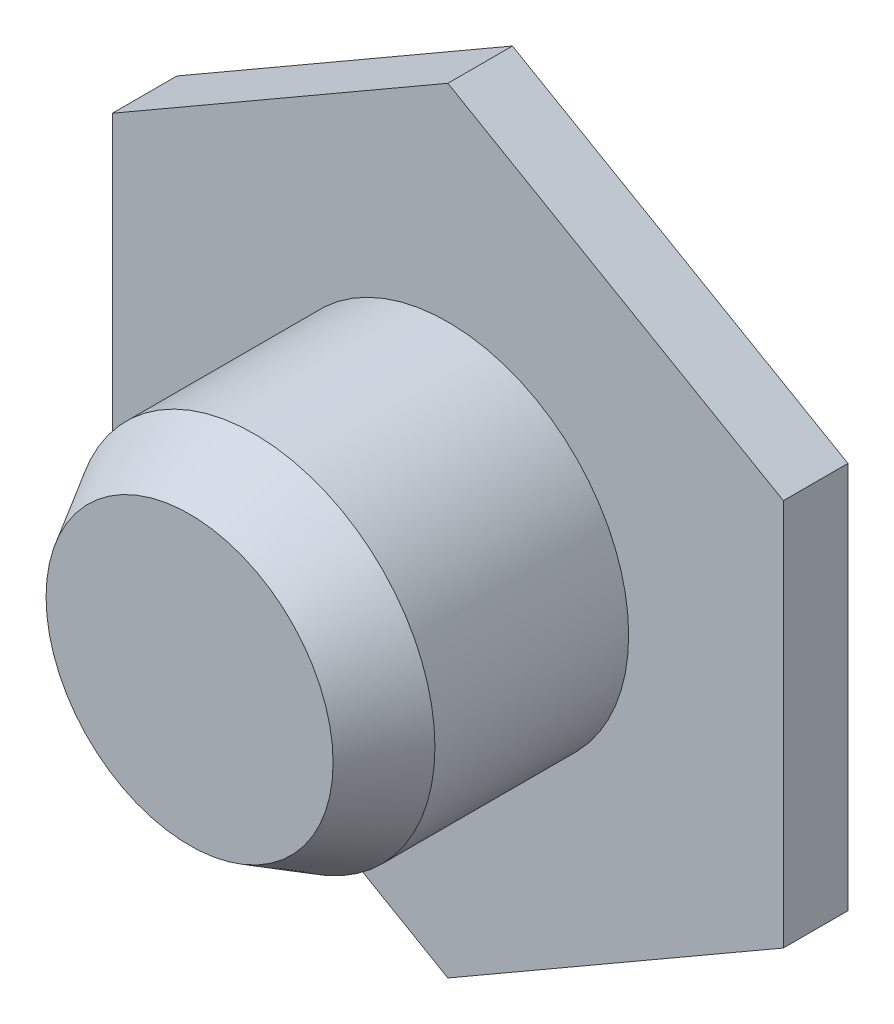
ISO-10303-21;
HEADER;
FILE_DESCRIPTION(('STEP AP214'),'2;1');
FILE_NAME('part.step','',(''),(''),'','','');
FILE_SCHEMA(('AUTOMOTIVE_DESIGN { 1 0 10303 214 1 1 1 1 }'));
ENDSEC;
DATA;
#1=APPLICATION_CONTEXT('core data for automotive mechanical design processes');
#2=APPLICATION_PROTOCOL_DEFINITION('international standard','automotive_design',2000,#1);
#3=PRODUCT_CONTEXT('',#1,'mechanical');
#4=PRODUCT('Part','Part','',(#3));
#5=PRODUCT_RELATED_PRODUCT_CATEGORY('part','',(#4));
#6=PRODUCT_DEFINITION_FORMATION('','',#4);
#7=PRODUCT_DEFINITION_CONTEXT('part definition',#1,'design');
#8=PRODUCT_DEFINITION('design','',#6,#7);
#9=PRODUCT_DEFINITION_SHAPE('','',#8);
#10=(LENGTH_UNIT() NAMED_UNIT(*) SI_UNIT(.MILLI.,.METRE.));
#11=(NAMED_UNIT(*) PLANE_ANGLE_UNIT() SI_UNIT($,.RADIAN.));
#12=(NAMED_UNIT(*) SI_UNIT($,.STERADIAN.) SOLID_ANGLE_UNIT());
#13=UNCERTAINTY_MEASURE_WITH_UNIT(LENGTH_MEASURE(1.E-05),#10,'distance_accuracy_value','');
#14=(GEOMETRIC_REPRESENTATION_CONTEXT(3) GLOBAL_UNCERTAINTY_ASSIGNED_CONTEXT((#13)) GLOBAL_UNIT_ASSIGNED_CONTEXT((#10,
#11,#12)) REPRESENTATION_CONTEXT('',''));
#15=CARTESIAN_POINT('',(0.,0.,0.));
#16=DIRECTION('',(0.,0.,1.));
#17=DIRECTION('',(1.,0.,0.));
#18=AXIS2_PLACEMENT_3D('',#15,#16,#17);
#19=CARTESIAN_POINT('',(0.,0.,0.5));
#20=DIRECTION('',(0.,0.,1.));
#21=DIRECTION('',(1.,0.,0.));
#22=AXIS2_PLACEMENT_3D('',#19,#20,#21);
#23=PLANE('',#22);
#24=DIRECTION('',(-0.866025403784439,0.5,0.));
#25=VECTOR('',#24,1.);
#26=CARTESIAN_POINT('',(2.59807621135331,1.5,0.5));
#27=LINE('',#26,#25);
#28=CARTESIAN_POINT('',(2.59807621135331,1.5,0.5));
#29=VERTEX_POINT('',#28);
#30=CARTESIAN_POINT('',(0.,3.,0.5));
#31=VERTEX_POINT('',#30);
#32=EDGE_CURVE('E129',#29,#31,#27,.T.);
#33=ORIENTED_EDGE('',*,*,#32,.T.);
#34=DIRECTION('',(-0.866025403784439,-0.5,0.));
#35=VECTOR('',#34,1.);
#36=CARTESIAN_POINT('',(0.,3.,0.5));
#37=LINE('',#36,#35);
#38=CARTESIAN_POINT('',(-2.59807621135332,1.5,0.5));
#39=VERTEX_POINT('',#38);
#40=EDGE_CURVE('E87',#31,#39,#37,.T.);
#41=ORIENTED_EDGE('',*,*,#40,.T.);
#42=DIRECTION('',(0.,-1.,0.));
#43=VECTOR('',#42,1.);
#44=CARTESIAN_POINT('',(-2.59807621135332,1.5,0.5));
#45=LINE('',#44,#43);
#46=CARTESIAN_POINT('',(-2.59807621135331,-1.5,0.5));
#47=VERTEX_POINT('',#46);
#48=EDGE_CURVE('E100',#39,#47,#45,.T.);
#49=ORIENTED_EDGE('',*,*,#48,.T.);
#50=DIRECTION('',(0.866025403784439,-0.5,0.));
#51=VECTOR('',#50,1.);
#52=CARTESIAN_POINT('',(-2.59807621135331,-1.5,0.5));
#53=LINE('',#52,#51);
#54=CARTESIAN_POINT('',(0.,-3.,0.5));
#55=VERTEX_POINT('',#54);
#56=EDGE_CURVE('E94',#47,#55,#53,.T.);
#57=ORIENTED_EDGE('',*,*,#56,.T.);
#58=DIRECTION('',(0.866025403784439,0.5,0.));
#59=VECTOR('',#58,1.);
#60=CARTESIAN_POINT('',(0.,-3.,0.5));
#61=LINE('',#60,#59);
#62=CARTESIAN_POINT('',(2.59807621135331,-1.5,0.5));
#63=VERTEX_POINT('',#62);
#64=EDGE_CURVE('E98',#55,#63,#61,.T.);
#65=ORIENTED_EDGE('',*,*,#64,.T.);
#66=DIRECTION('',(0.,1.,0.));
#67=VECTOR('',#66,1.);
#68=CARTESIAN_POINT('',(2.59807621135331,-1.5,0.5));
#69=LINE('',#68,#67);
#70=EDGE_CURVE('E50',#63,#29,#69,.T.);
#71=ORIENTED_EDGE('',*,*,#70,.T.);
#72=EDGE_LOOP('',(#33,#41,#49,#57,#65,#71));
#73=FACE_BOUND('',#72,.T.);
#74=CARTESIAN_POINT('',(0.,0.,0.5));
#75=DIRECTION('',(0.,0.,1.));
#76=DIRECTION('',(1.,0.,0.));
#77=AXIS2_PLACEMENT_3D('',#74,#75,#76);
#78=CIRCLE('',#77,1.4);
#79=CARTESIAN_POINT('',(1.4,0.,0.5));
#80=VERTEX_POINT('',#79);
#81=EDGE_CURVE('E174',#80,#80,#78,.T.);
#82=ORIENTED_EDGE('',*,*,#81,.F.);
#83=EDGE_LOOP('',(#82));
#84=FACE_BOUND('',#83,.T.);
#85=ADVANCED_FACE('F33',(#73,#84),#23,.T.);
#86=CARTESIAN_POINT('',(2.59807621135331,1.5,0.5));
#87=DIRECTION('',(-0.5,-0.866025403784439,0.));
#88=DIRECTION('',(0.866025403784439,-0.5,0.));
#89=AXIS2_PLACEMENT_3D('',#86,#87,#88);
#90=PLANE('',#89);
#91=DIRECTION('',(-0.866025403784439,0.5,0.));
#92=VECTOR('',#91,1.);
#93=CARTESIAN_POINT('',(2.59807621135331,1.5,0.));
#94=LINE('',#93,#92);
#95=CARTESIAN_POINT('',(2.59807621135331,1.5,0.));
#96=VERTEX_POINT('',#95);
#97=CARTESIAN_POINT('',(0.,3.,0.));
#98=VERTEX_POINT('',#97);
#99=EDGE_CURVE('E118',#96,#98,#94,.T.);
#100=ORIENTED_EDGE('',*,*,#99,.T.);
#101=DIRECTION('',(0.,0.,-1.));
#102=VECTOR('',#101,1.);
#103=CARTESIAN_POINT('',(0.,3.,0.5));
#104=LINE('',#103,#102);
#105=EDGE_CURVE('E11',#31,#98,#104,.T.);
#106=ORIENTED_EDGE('',*,*,#105,.F.);
#107=ORIENTED_EDGE('',*,*,#32,.F.);
#108=DIRECTION('',(0.,0.,-1.));
#109=VECTOR('',#108,1.);
#110=CARTESIAN_POINT('',(2.59807621135331,1.5,0.5));
#111=LINE('',#110,#109);
#112=EDGE_CURVE('E114',#29,#96,#111,.T.);
#113=ORIENTED_EDGE('',*,*,#112,.T.);
#114=EDGE_LOOP('',(#100,#106,#107,#113));
#115=FACE_BOUND('',#114,.T.);
#116=ADVANCED_FACE('F35',(#115),#90,.F.);
#117=CARTESIAN_POINT('',(0.,3.,0.5));
#118=DIRECTION('',(0.5,-0.866025403784439,0.));
#119=DIRECTION('',(0.866025403784439,0.5,0.));
#120=AXIS2_PLACEMENT_3D('',#117,#118,#119);
#121=PLANE('',#120);
#122=DIRECTION('',(-0.866025403784439,-0.5,0.));
#123=VECTOR('',#122,1.);
#124=CARTESIAN_POINT('',(0.,3.,0.));
#125=LINE('',#124,#123);
#126=CARTESIAN_POINT('',(-2.59807621135332,1.5,0.));
#127=VERTEX_POINT('',#126);
#128=EDGE_CURVE('E121',#98,#127,#125,.T.);
#129=ORIENTED_EDGE('',*,*,#128,.T.);
#130=DIRECTION('',(0.,0.,-1.));
#131=VECTOR('',#130,1.);
#132=CARTESIAN_POINT('',(-2.59807621135332,1.5,0.5));
#133=LINE('',#132,#131);
#134=EDGE_CURVE('E42',#39,#127,#133,.T.);
#135=ORIENTED_EDGE('',*,*,#134,.F.);
#136=ORIENTED_EDGE('',*,*,#40,.F.);
#137=ORIENTED_EDGE('',*,*,#105,.T.);
#138=EDGE_LOOP('',(#129,#135,#136,#137));
#139=FACE_BOUND('',#138,.T.);
#140=ADVANCED_FACE('F157',(#139),#121,.F.);
#141=CARTESIAN_POINT('',(-2.59807621135332,1.5,0.5));
#142=DIRECTION('',(1.,0.,0.));
#143=DIRECTION('',(0.,1.,0.));
#144=AXIS2_PLACEMENT_3D('',#141,#142,#143);
#145=PLANE('',#144);
#146=DIRECTION('',(0.,-1.,0.));
#147=VECTOR('',#146,1.);
#148=CARTESIAN_POINT('',(-2.59807621135332,1.5,0.));
#149=LINE('',#148,#147);
#150=CARTESIAN_POINT('',(-2.59807621135331,-1.5,0.));
#151=VERTEX_POINT('',#150);
#152=EDGE_CURVE('E124',#127,#151,#149,.T.);
#153=ORIENTED_EDGE('',*,*,#152,.T.);
#154=DIRECTION('',(0.,0.,-1.));
#155=VECTOR('',#154,1.);
#156=CARTESIAN_POINT('',(-2.59807621135331,-1.5,0.5));
#157=LINE('',#156,#155);
#158=EDGE_CURVE('E109',#47,#151,#157,.T.);
#159=ORIENTED_EDGE('',*,*,#158,.F.);
#160=ORIENTED_EDGE('',*,*,#48,.F.);
#161=ORIENTED_EDGE('',*,*,#134,.T.);
#162=EDGE_LOOP('',(#153,#159,#160,#161));
#163=FACE_BOUND('',#162,.T.);
#164=ADVANCED_FACE('F135',(#163),#145,.F.);
#165=CARTESIAN_POINT('',(-2.59807621135331,-1.5,0.5));
#166=DIRECTION('',(0.5,0.866025403784439,0.));
#167=DIRECTION('',(-0.866025403784439,0.5,0.));
#168=AXIS2_PLACEMENT_3D('',#165,#166,#167);
#169=PLANE('',#168);
#170=DIRECTION('',(0.866025403784439,-0.5,0.));
#171=VECTOR('',#170,1.);
#172=CARTESIAN_POINT('',(-2.59807621135331,-1.5,0.));
#173=LINE('',#172,#171);
#174=CARTESIAN_POINT('',(0.,-3.,0.));
#175=VERTEX_POINT('',#174);
#176=EDGE_CURVE('E108',#151,#175,#173,.T.);
#177=ORIENTED_EDGE('',*,*,#176,.T.);
#178=DIRECTION('',(0.,0.,-1.));
#179=VECTOR('',#178,1.);
#180=CARTESIAN_POINT('',(0.,-3.,0.5));
#181=LINE('',#180,#179);
#182=EDGE_CURVE('E105',#55,#175,#181,.T.);
#183=ORIENTED_EDGE('',*,*,#182,.F.);
#184=ORIENTED_EDGE('',*,*,#56,.F.);
#185=ORIENTED_EDGE('',*,*,#158,.T.);
#186=EDGE_LOOP('',(#177,#183,#184,#185));
#187=FACE_BOUND('',#186,.T.);
#188=ADVANCED_FACE('F106',(#187),#169,.F.);
#189=CARTESIAN_POINT('',(0.,-3.,0.5));
#190=DIRECTION('',(-0.5,0.866025403784439,0.));
#191=DIRECTION('',(-0.866025403784439,-0.5,0.));
#192=AXIS2_PLACEMENT_3D('',#189,#190,#191);
#193=PLANE('',#192);
#194=DIRECTION('',(0.866025403784439,0.5,0.));
#195=VECTOR('',#194,1.);
#196=CARTESIAN_POINT('',(0.,-3.,0.));
#197=LINE('',#196,#195);
#198=CARTESIAN_POINT('',(2.59807621135331,-1.5,0.));
#199=VERTEX_POINT('',#198);
#200=EDGE_CURVE('E73',#175,#199,#197,.T.);
#201=ORIENTED_EDGE('',*,*,#200,.T.);
#202=DIRECTION('',(0.,0.,-1.));
#203=VECTOR('',#202,1.);
#204=CARTESIAN_POINT('',(2.59807621135331,-1.5,0.5));
#205=LINE('',#204,#203);
#206=EDGE_CURVE('E110',#63,#199,#205,.T.);
#207=ORIENTED_EDGE('',*,*,#206,.F.);
#208=ORIENTED_EDGE('',*,*,#64,.F.);
#209=ORIENTED_EDGE('',*,*,#182,.T.);
#210=EDGE_LOOP('',(#201,#207,#208,#209));
#211=FACE_BOUND('',#210,.T.);
#212=ADVANCED_FACE('F112',(#211),#193,.F.);
#213=CARTESIAN_POINT('',(2.59807621135331,-1.5,0.5));
#214=DIRECTION('',(-1.,0.,0.));
#215=DIRECTION('',(0.,-1.,0.));
#216=AXIS2_PLACEMENT_3D('',#213,#214,#215);
#217=PLANE('',#216);
#218=DIRECTION('',(0.,1.,0.));
#219=VECTOR('',#218,1.);
#220=CARTESIAN_POINT('',(2.59807621135331,-1.5,0.));
#221=LINE('',#220,#219);
#222=EDGE_CURVE('E79',#199,#96,#221,.T.);
#223=ORIENTED_EDGE('',*,*,#222,.T.);
#224=ORIENTED_EDGE('',*,*,#112,.F.);
#225=ORIENTED_EDGE('',*,*,#70,.F.);
#226=ORIENTED_EDGE('',*,*,#206,.T.);
#227=EDGE_LOOP('',(#223,#224,#225,#226));
#228=FACE_BOUND('',#227,.T.);
#229=ADVANCED_FACE('F142',(#228),#217,.F.);
#230=CARTESIAN_POINT('',(0.,0.,0.));
#231=DIRECTION('',(0.,0.,1.));
#232=DIRECTION('',(1.,0.,0.));
#233=AXIS2_PLACEMENT_3D('',#230,#231,#232);
#234=PLANE('',#233);
#235=ORIENTED_EDGE('',*,*,#99,.F.);
#236=ORIENTED_EDGE('',*,*,#222,.F.);
#237=ORIENTED_EDGE('',*,*,#200,.F.);
#238=ORIENTED_EDGE('',*,*,#176,.F.);
#239=ORIENTED_EDGE('',*,*,#152,.F.);
#240=ORIENTED_EDGE('',*,*,#128,.F.);
#241=EDGE_LOOP('',(#235,#236,#237,#238,#239,#240));
#242=FACE_BOUND('',#241,.T.);
#243=ADVANCED_FACE('F138',(#242),#234,.F.);
#244=CARTESIAN_POINT('',(0.,0.,2.));
#245=DIRECTION('',(0.,0.,-1.));
#246=DIRECTION('',(-1.,0.,0.));
#247=AXIS2_PLACEMENT_3D('',#244,#245,#246);
#248=CYLINDRICAL_SURFACE('',#247,1.4);
#249=CARTESIAN_POINT('',(0.,0.,2.));
#250=DIRECTION('',(0.,0.,1.));
#251=DIRECTION('',(1.,0.,0.));
#252=AXIS2_PLACEMENT_3D('',#249,#250,#251);
#253=CIRCLE('',#252,1.4);
#254=CARTESIAN_POINT('',(1.4,0.,2.));
#255=VERTEX_POINT('',#254);
#256=EDGE_CURVE('E122',#255,#255,#253,.T.);
#257=ORIENTED_EDGE('',*,*,#256,.F.);
#258=EDGE_LOOP('',(#257));
#259=FACE_BOUND('',#258,.T.);
#260=ORIENTED_EDGE('',*,*,#81,.T.);
#261=EDGE_LOOP('',(#260));
#262=FACE_BOUND('',#261,.T.);
#263=ADVANCED_FACE('F149',(#259,#262),#248,.T.);
#264=CARTESIAN_POINT('',(0.,0.,2.));
#265=DIRECTION('',(0.,0.,-1.));
#266=DIRECTION('',(1.,0.,0.));
#267=AXIS2_PLACEMENT_3D('',#264,#265,#266);
#268=CONICAL_SURFACE('',#267,1.4,0.5235987755983);
#269=CARTESIAN_POINT('',(0.,0.,2.5));
#270=DIRECTION('',(0.,0.,1.));
#271=DIRECTION('',(1.,0.,0.));
#272=AXIS2_PLACEMENT_3D('',#269,#270,#271);
#273=CIRCLE('',#272,1.11132486540519);
#274=CARTESIAN_POINT('',(1.11132486540519,0.,2.5));
#275=VERTEX_POINT('',#274);
#276=EDGE_CURVE('E173',#275,#275,#273,.T.);
#277=ORIENTED_EDGE('',*,*,#276,.F.);
#278=EDGE_LOOP('',(#277));
#279=FACE_BOUND('',#278,.T.);
#280=ORIENTED_EDGE('',*,*,#256,.T.);
#281=EDGE_LOOP('',(#280));
#282=FACE_BOUND('',#281,.T.);
#283=ADVANCED_FACE('F161',(#279,#282),#268,.T.);
#284=CARTESIAN_POINT('',(0.,0.,2.5));
#285=DIRECTION('',(0.,0.,1.));
#286=DIRECTION('',(1.,0.,0.));
#287=AXIS2_PLACEMENT_3D('',#284,#285,#286);
#288=PLANE('',#287);
#289=ORIENTED_EDGE('',*,*,#276,.T.);
#290=EDGE_LOOP('',(#289));
#291=FACE_BOUND('',#290,.T.);
#292=ADVANCED_FACE('F165',(#291),#288,.T.);
#293=CLOSED_SHELL('',(#85,#116,#140,#164,#188,#212,#229,#243,#263,#283,#292));
#294=MANIFOLD_SOLID_BREP('B2',#293);
#295=ADVANCED_BREP_SHAPE_REPRESENTATION('',(#18,#294),#14);
#296=SHAPE_DEFINITION_REPRESENTATION(#9,#295);
ENDSEC;
END-ISO-10303-21;
